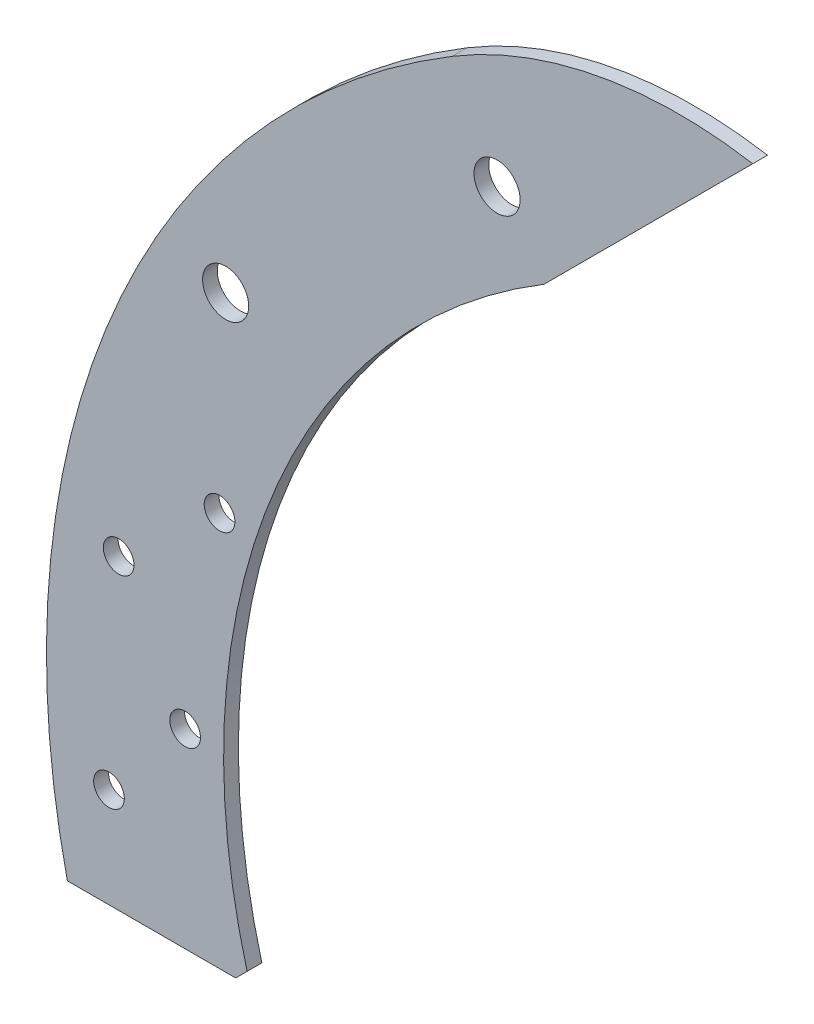
ISO-10303-21;
HEADER;
FILE_DESCRIPTION(('STEP AP214'),'2;1');
FILE_NAME('part.step','',(''),(''),'','','');
FILE_SCHEMA(('AUTOMOTIVE_DESIGN { 1 0 10303 214 1 1 1 1 }'));
ENDSEC;
DATA;
#1=APPLICATION_CONTEXT('core data for automotive mechanical design processes');
#2=APPLICATION_PROTOCOL_DEFINITION('international standard','automotive_design',2000,#1);
#3=PRODUCT_CONTEXT('',#1,'mechanical');
#4=PRODUCT('Part','Part','',(#3));
#5=PRODUCT_RELATED_PRODUCT_CATEGORY('part','',(#4));
#6=PRODUCT_DEFINITION_FORMATION('','',#4);
#7=PRODUCT_DEFINITION_CONTEXT('part definition',#1,'design');
#8=PRODUCT_DEFINITION('design','',#6,#7);
#9=PRODUCT_DEFINITION_SHAPE('','',#8);
#10=(LENGTH_UNIT() NAMED_UNIT(*) SI_UNIT(.MILLI.,.METRE.));
#11=(NAMED_UNIT(*) PLANE_ANGLE_UNIT() SI_UNIT($,.RADIAN.));
#12=(NAMED_UNIT(*) SI_UNIT($,.STERADIAN.) SOLID_ANGLE_UNIT());
#13=UNCERTAINTY_MEASURE_WITH_UNIT(LENGTH_MEASURE(1.E-05),#10,'distance_accuracy_value','');
#14=(GEOMETRIC_REPRESENTATION_CONTEXT(3) GLOBAL_UNCERTAINTY_ASSIGNED_CONTEXT((#13)) GLOBAL_UNIT_ASSIGNED_CONTEXT((#10,
#11,#12)) REPRESENTATION_CONTEXT('',''));
#15=CARTESIAN_POINT('',(0.,0.,0.));
#16=DIRECTION('',(0.,0.,1.));
#17=DIRECTION('',(1.,0.,0.));
#18=AXIS2_PLACEMENT_3D('',#15,#16,#17);
#19=CARTESIAN_POINT('',(-136.505752304852,-34.0622261500945,3.175));
#20=DIRECTION('',(-0.707106781186507,0.707106781186587,0.));
#21=DIRECTION('',(-0.707106781186588,-0.707106781186507,0.));
#22=AXIS2_PLACEMENT_3D('',#19,#20,#21);
#23=PLANE('',#22);
#24=DIRECTION('',(0.707106781186588,0.707106781186507,0.));
#25=VECTOR('',#24,1.);
#26=CARTESIAN_POINT('',(-136.505752304852,-34.0622261500945,0.));
#27=LINE('',#26,#25);
#28=CARTESIAN_POINT('',(-138.956026154758,-36.5125,0.));
#29=VERTEX_POINT('',#28);
#30=CARTESIAN_POINT('',(-136.505752304852,-34.0622261500946,0.));
#31=VERTEX_POINT('',#30);
#32=EDGE_CURVE('E119',#29,#31,#27,.T.);
#33=ORIENTED_EDGE('',*,*,#32,.T.);
#34=DIRECTION('',(0.,0.,-1.));
#35=VECTOR('',#34,1.);
#36=CARTESIAN_POINT('',(-136.505752304852,-34.0622261500946,3.175));
#37=LINE('',#36,#35);
#38=CARTESIAN_POINT('',(-136.505752304852,-34.0622261500946,3.175));
#39=VERTEX_POINT('',#38);
#40=EDGE_CURVE('E11',#39,#31,#37,.T.);
#41=ORIENTED_EDGE('',*,*,#40,.F.);
#42=DIRECTION('',(0.707106781186588,0.707106781186507,0.));
#43=VECTOR('',#42,1.);
#44=CARTESIAN_POINT('',(-136.505752304852,-34.0622261500945,3.175));
#45=LINE('',#44,#43);
#46=CARTESIAN_POINT('',(-138.956026154758,-36.5125,3.175));
#47=VERTEX_POINT('',#46);
#48=EDGE_CURVE('E130',#47,#39,#45,.T.);
#49=ORIENTED_EDGE('',*,*,#48,.F.);
#50=DIRECTION('',(0.,0.,-1.));
#51=VECTOR('',#50,1.);
#52=CARTESIAN_POINT('',(-138.956026154758,-36.5125,3.175));
#53=LINE('',#52,#51);
#54=EDGE_CURVE('E115',#47,#29,#53,.T.);
#55=ORIENTED_EDGE('',*,*,#54,.T.);
#56=EDGE_LOOP('',(#33,#41,#49,#55));
#57=FACE_BOUND('',#56,.T.);
#58=ADVANCED_FACE('F35',(#57),#23,.F.);
#59=CARTESIAN_POINT('',(1.357884,3.589528,3.175));
#60=DIRECTION('',(0.,0.,-1.));
#61=DIRECTION('',(-1.,0.,0.));
#62=AXIS2_PLACEMENT_3D('',#59,#60,#61);
#63=CYLINDRICAL_SURFACE('',#62,142.912689449803);
#64=CARTESIAN_POINT('',(1.357884,3.589528,0.));
#65=DIRECTION('',(0.,0.,-1.));
#66=DIRECTION('',(-1.,0.,0.));
#67=AXIS2_PLACEMENT_3D('',#64,#65,#66);
#68=CIRCLE('',#67,142.912689449803);
#69=CARTESIAN_POINT('',(-72.6557224668079,125.843455804191,0.));
#70=VERTEX_POINT('',#69);
#71=EDGE_CURVE('E122',#31,#70,#68,.T.);
#72=ORIENTED_EDGE('',*,*,#71,.T.);
#73=DIRECTION('',(0.,0.,-1.));
#74=VECTOR('',#73,1.);
#75=CARTESIAN_POINT('',(-72.6557224668079,125.843455804191,3.175));
#76=LINE('',#75,#74);
#77=CARTESIAN_POINT('',(-72.6557224668079,125.843455804191,3.175));
#78=VERTEX_POINT('',#77);
#79=EDGE_CURVE('E43',#78,#70,#76,.T.);
#80=ORIENTED_EDGE('',*,*,#79,.F.);
#81=CARTESIAN_POINT('',(1.357884,3.589528,3.175));
#82=DIRECTION('',(0.,0.,-1.));
#83=DIRECTION('',(-1.,0.,0.));
#84=AXIS2_PLACEMENT_3D('',#81,#82,#83);
#85=CIRCLE('',#84,142.912689449803);
#86=EDGE_CURVE('E88',#39,#78,#85,.T.);
#87=ORIENTED_EDGE('',*,*,#86,.F.);
#88=ORIENTED_EDGE('',*,*,#40,.T.);
#89=EDGE_LOOP('',(#72,#80,#87,#88));
#90=FACE_BOUND('',#89,.T.);
#91=ADVANCED_FACE('F156',(#90),#63,.F.);
#92=CARTESIAN_POINT('',(-72.6557224668079,125.843455804191,3.175));
#93=DIRECTION('',(-0.707106781186549,0.707106781186546,0.));
#94=DIRECTION('',(-0.707106781186546,-0.707106781186549,0.));
#95=AXIS2_PLACEMENT_3D('',#92,#93,#94);
#96=PLANE('',#95);
#97=DIRECTION('',(0.707106781186546,0.707106781186549,0.));
#98=VECTOR('',#97,1.);
#99=CARTESIAN_POINT('',(-72.6557224668079,125.843455804191,0.));
#100=LINE('',#99,#98);
#101=CARTESIAN_POINT('',(-27.7544418614623,170.744736409537,0.));
#102=VERTEX_POINT('',#101);
#103=EDGE_CURVE('E125',#70,#102,#100,.T.);
#104=ORIENTED_EDGE('',*,*,#103,.T.);
#105=DIRECTION('',(0.,0.,-1.));
#106=VECTOR('',#105,1.);
#107=CARTESIAN_POINT('',(-27.7544418614623,170.744736409537,3.175));
#108=LINE('',#107,#106);
#109=CARTESIAN_POINT('',(-27.7544418614623,170.744736409537,3.175));
#110=VERTEX_POINT('',#109);
#111=EDGE_CURVE('E110',#110,#102,#108,.T.);
#112=ORIENTED_EDGE('',*,*,#111,.F.);
#113=DIRECTION('',(0.707106781186546,0.707106781186549,0.));
#114=VECTOR('',#113,1.);
#115=CARTESIAN_POINT('',(-72.6557224668079,125.843455804191,3.175));
#116=LINE('',#115,#114);
#117=EDGE_CURVE('E101',#78,#110,#116,.T.);
#118=ORIENTED_EDGE('',*,*,#117,.F.);
#119=ORIENTED_EDGE('',*,*,#79,.T.);
#120=EDGE_LOOP('',(#104,#112,#118,#119));
#121=FACE_BOUND('',#120,.T.);
#122=ADVANCED_FACE('F136',(#121),#96,.F.);
#123=CARTESIAN_POINT('',(-43.529912777874,77.7341309796209,3.175));
#124=DIRECTION('',(0.,0.,-1.));
#125=DIRECTION('',(-1.,0.,0.));
#126=AXIS2_PLACEMENT_3D('',#123,#124,#125);
#127=CYLINDRICAL_SURFACE('',#126,94.338953805276);
#128=CARTESIAN_POINT('',(-43.529912777874,77.7341309796209,0.));
#129=DIRECTION('',(0.,0.,1.));
#130=DIRECTION('',(-1.,0.,0.));
#131=AXIS2_PLACEMENT_3D('',#128,#129,#130);
#132=CIRCLE('',#131,94.338953805276);
#133=CARTESIAN_POINT('',(-92.3874790885732,158.435905552858,0.));
#134=VERTEX_POINT('',#133);
#135=EDGE_CURVE('E109',#102,#134,#132,.T.);
#136=ORIENTED_EDGE('',*,*,#135,.T.);
#137=DIRECTION('',(0.,0.,-1.));
#138=VECTOR('',#137,1.);
#139=CARTESIAN_POINT('',(-92.3874790885732,158.435905552858,3.175));
#140=LINE('',#139,#138);
#141=CARTESIAN_POINT('',(-92.3874790885732,158.435905552858,3.175));
#142=VERTEX_POINT('',#141);
#143=EDGE_CURVE('E106',#142,#134,#140,.T.);
#144=ORIENTED_EDGE('',*,*,#143,.F.);
#145=CARTESIAN_POINT('',(-43.529912777874,77.7341309796209,3.175));
#146=DIRECTION('',(0.,0.,1.));
#147=DIRECTION('',(-1.,0.,0.));
#148=AXIS2_PLACEMENT_3D('',#145,#146,#147);
#149=CIRCLE('',#148,94.338953805276);
#150=EDGE_CURVE('E95',#110,#142,#149,.T.);
#151=ORIENTED_EDGE('',*,*,#150,.F.);
#152=ORIENTED_EDGE('',*,*,#111,.T.);
#153=EDGE_LOOP('',(#136,#144,#151,#152));
#154=FACE_BOUND('',#153,.T.);
#155=ADVANCED_FACE('F107',(#154),#127,.T.);
#156=CARTESIAN_POINT('',(1.357884,3.589528,3.175));
#157=DIRECTION('',(0.,0.,-1.));
#158=DIRECTION('',(-1.,0.,0.));
#159=AXIS2_PLACEMENT_3D('',#156,#157,#158);
#160=CYLINDRICAL_SURFACE('',#159,181.012689449803);
#161=CARTESIAN_POINT('',(1.357884,3.589528,0.));
#162=DIRECTION('',(0.,0.,1.));
#163=DIRECTION('',(-1.,0.,0.));
#164=AXIS2_PLACEMENT_3D('',#161,#162,#163);
#165=CIRCLE('',#164,181.012689449803);
#166=CARTESIAN_POINT('',(-175.156764378365,-36.5125,0.));
#167=VERTEX_POINT('',#166);
#168=EDGE_CURVE('E74',#134,#167,#165,.T.);
#169=ORIENTED_EDGE('',*,*,#168,.T.);
#170=DIRECTION('',(0.,0.,-1.));
#171=VECTOR('',#170,1.);
#172=CARTESIAN_POINT('',(-175.156764378365,-36.5125,3.175));
#173=LINE('',#172,#171);
#174=CARTESIAN_POINT('',(-175.156764378365,-36.5125,3.175));
#175=VERTEX_POINT('',#174);
#176=EDGE_CURVE('E111',#175,#167,#173,.T.);
#177=ORIENTED_EDGE('',*,*,#176,.F.);
#178=CARTESIAN_POINT('',(1.357884,3.589528,3.175));
#179=DIRECTION('',(0.,0.,1.));
#180=DIRECTION('',(-1.,0.,0.));
#181=AXIS2_PLACEMENT_3D('',#178,#179,#180);
#182=CIRCLE('',#181,181.012689449803);
#183=EDGE_CURVE('E99',#142,#175,#182,.T.);
#184=ORIENTED_EDGE('',*,*,#183,.F.);
#185=ORIENTED_EDGE('',*,*,#143,.T.);
#186=EDGE_LOOP('',(#169,#177,#184,#185));
#187=FACE_BOUND('',#186,.T.);
#188=ADVANCED_FACE('F113',(#187),#160,.T.);
#189=CARTESIAN_POINT('',(-138.956026154758,-36.5125,3.175));
#190=DIRECTION('',(0.,1.,0.));
#191=DIRECTION('',(0.,0.,1.));
#192=AXIS2_PLACEMENT_3D('',#189,#190,#191);
#193=PLANE('',#192);
#194=DIRECTION('',(1.,0.,0.));
#195=VECTOR('',#194,1.);
#196=CARTESIAN_POINT('',(-138.956026154758,-36.5125,0.));
#197=LINE('',#196,#195);
#198=EDGE_CURVE('E80',#167,#29,#197,.T.);
#199=ORIENTED_EDGE('',*,*,#198,.T.);
#200=ORIENTED_EDGE('',*,*,#54,.F.);
#201=DIRECTION('',(1.,0.,0.));
#202=VECTOR('',#201,1.);
#203=CARTESIAN_POINT('',(-138.956026154758,-36.5125,3.175));
#204=LINE('',#203,#202);
#205=EDGE_CURVE('E51',#175,#47,#204,.T.);
#206=ORIENTED_EDGE('',*,*,#205,.F.);
#207=ORIENTED_EDGE('',*,*,#176,.T.);
#208=EDGE_LOOP('',(#199,#200,#206,#207));
#209=FACE_BOUND('',#208,.T.);
#210=ADVANCED_FACE('F143',(#209),#193,.F.);
#211=CARTESIAN_POINT('',(1.357884,3.589528,3.175));
#212=DIRECTION('',(0.,0.,-1.));
#213=DIRECTION('',(-1.,0.,0.));
#214=AXIS2_PLACEMENT_3D('',#211,#212,#213);
#215=PLANE('',#214);
#216=CARTESIAN_POINT('',(-82.7470550017742,138.994736409537,3.175));
#217=DIRECTION('',(0.,0.,1.));
#218=DIRECTION('',(1.,0.,0.));
#219=AXIS2_PLACEMENT_3D('',#216,#217,#218);
#220=CIRCLE('',#219,4.96100099999999);
#221=CARTESIAN_POINT('',(-77.7860540017742,138.994736409537,3.175));
#222=VERTEX_POINT('',#221);
#223=EDGE_CURVE('E257',#222,#222,#220,.T.);
#224=ORIENTED_EDGE('',*,*,#223,.F.);
#225=EDGE_LOOP('',(#224));
#226=FACE_BOUND('',#225,.T.);
#227=CARTESIAN_POINT('',(-141.11964156744,90.0143205514218,3.175));
#228=DIRECTION('',(0.,0.,1.));
#229=DIRECTION('',(1.,0.,0.));
#230=AXIS2_PLACEMENT_3D('',#227,#228,#229);
#231=CIRCLE('',#230,4.96100099999999);
#232=CARTESIAN_POINT('',(-136.15864056744,90.0143205514218,3.175));
#233=VERTEX_POINT('',#232);
#234=EDGE_CURVE('E259',#233,#233,#231,.T.);
#235=ORIENTED_EDGE('',*,*,#234,.F.);
#236=EDGE_LOOP('',(#235));
#237=FACE_BOUND('',#236,.T.);
#238=CARTESIAN_POINT('',(-166.205357893552,-15.0736471775281,3.175));
#239=DIRECTION('',(0.,0.,1.));
#240=DIRECTION('',(1.,0.,0.));
#241=AXIS2_PLACEMENT_3D('',#238,#239,#240);
#242=CIRCLE('',#241,3.30200000000001);
#243=CARTESIAN_POINT('',(-162.903357893552,-15.0736471775281,3.175));
#244=VERTEX_POINT('',#243);
#245=EDGE_CURVE('E267',#244,#244,#242,.T.);
#246=ORIENTED_EDGE('',*,*,#245,.F.);
#247=EDGE_LOOP('',(#246));
#248=FACE_BOUND('',#247,.T.);
#249=CARTESIAN_POINT('',(-164.125827505257,29.4335038147387,3.175));
#250=DIRECTION('',(0.,0.,1.));
#251=DIRECTION('',(1.,0.,0.));
#252=AXIS2_PLACEMENT_3D('',#249,#250,#251);
#253=CIRCLE('',#252,3.30200000000001);
#254=CARTESIAN_POINT('',(-160.823827505257,29.4335038147387,3.175));
#255=VERTEX_POINT('',#254);
#256=EDGE_CURVE('E273',#255,#255,#253,.T.);
#257=ORIENTED_EDGE('',*,*,#256,.F.);
#258=EDGE_LOOP('',(#257));
#259=FACE_BOUND('',#258,.T.);
#260=CARTESIAN_POINT('',(-149.837364130512,4.445,3.175));
#261=DIRECTION('',(0.,0.,1.));
#262=DIRECTION('',(1.,0.,0.));
#263=AXIS2_PLACEMENT_3D('',#260,#261,#262);
#264=CIRCLE('',#263,3.30200000000001);
#265=CARTESIAN_POINT('',(-146.535364130512,4.445,3.175));
#266=VERTEX_POINT('',#265);
#267=EDGE_CURVE('E279',#266,#266,#264,.T.);
#268=ORIENTED_EDGE('',*,*,#267,.F.);
#269=EDGE_LOOP('',(#268));
#270=FACE_BOUND('',#269,.T.);
#271=CARTESIAN_POINT('',(-142.42715530255,48.3478669589237,3.175));
#272=DIRECTION('',(0.,0.,1.));
#273=DIRECTION('',(1.,0.,0.));
#274=AXIS2_PLACEMENT_3D('',#271,#272,#273);
#275=CIRCLE('',#274,3.30200000000001);
#276=CARTESIAN_POINT('',(-139.12515530255,48.3478669589237,3.175));
#277=VERTEX_POINT('',#276);
#278=EDGE_CURVE('E285',#277,#277,#275,.T.);
#279=ORIENTED_EDGE('',*,*,#278,.F.);
#280=EDGE_LOOP('',(#279));
#281=FACE_BOUND('',#280,.T.);
#282=ORIENTED_EDGE('',*,*,#48,.T.);
#283=ORIENTED_EDGE('',*,*,#86,.T.);
#284=ORIENTED_EDGE('',*,*,#117,.T.);
#285=ORIENTED_EDGE('',*,*,#150,.T.);
#286=ORIENTED_EDGE('',*,*,#183,.T.);
#287=ORIENTED_EDGE('',*,*,#205,.T.);
#288=EDGE_LOOP('',(#282,#283,#284,#285,#286,#287));
#289=FACE_BOUND('',#288,.T.);
#290=ADVANCED_FACE('F97',(#226,#237,#248,#259,#270,#281,#289),#215,.F.);
#291=CARTESIAN_POINT('',(1.357884,3.589528,0.));
#292=DIRECTION('',(0.,0.,-1.));
#293=DIRECTION('',(-1.,0.,0.));
#294=AXIS2_PLACEMENT_3D('',#291,#292,#293);
#295=PLANE('',#294);
#296=CARTESIAN_POINT('',(-82.7470550017742,138.994736409537,0.));
#297=DIRECTION('',(0.,0.,1.));
#298=DIRECTION('',(1.,0.,0.));
#299=AXIS2_PLACEMENT_3D('',#296,#297,#298);
#300=CIRCLE('',#299,4.96100100000001);
#301=CARTESIAN_POINT('',(-77.7860540017742,138.994736409537,0.));
#302=VERTEX_POINT('',#301);
#303=EDGE_CURVE('E254',#302,#302,#300,.T.);
#304=ORIENTED_EDGE('',*,*,#303,.T.);
#305=EDGE_LOOP('',(#304));
#306=FACE_BOUND('',#305,.T.);
#307=CARTESIAN_POINT('',(-141.11964156744,90.0143205514218,0.));
#308=DIRECTION('',(0.,0.,1.));
#309=DIRECTION('',(1.,0.,0.));
#310=AXIS2_PLACEMENT_3D('',#307,#308,#309);
#311=CIRCLE('',#310,4.96100099999999);
#312=CARTESIAN_POINT('',(-136.15864056744,90.0143205514218,0.));
#313=VERTEX_POINT('',#312);
#314=EDGE_CURVE('E264',#313,#313,#311,.T.);
#315=ORIENTED_EDGE('',*,*,#314,.T.);
#316=EDGE_LOOP('',(#315));
#317=FACE_BOUND('',#316,.T.);
#318=CARTESIAN_POINT('',(-166.205357893552,-15.0736471775281,0.));
#319=DIRECTION('',(0.,0.,-1.));
#320=DIRECTION('',(-1.,0.,0.));
#321=AXIS2_PLACEMENT_3D('',#318,#319,#320);
#322=CIRCLE('',#321,3.30200000000001);
#323=CARTESIAN_POINT('',(-169.507357893552,-15.0736471775281,0.));
#324=VERTEX_POINT('',#323);
#325=EDGE_CURVE('E270',#324,#324,#322,.F.);
#326=ORIENTED_EDGE('',*,*,#325,.T.);
#327=EDGE_LOOP('',(#326));
#328=FACE_BOUND('',#327,.T.);
#329=CARTESIAN_POINT('',(-164.125827505257,29.4335038147387,0.));
#330=DIRECTION('',(0.,0.,-1.));
#331=DIRECTION('',(-1.,0.,0.));
#332=AXIS2_PLACEMENT_3D('',#329,#330,#331);
#333=CIRCLE('',#332,3.30200000000001);
#334=CARTESIAN_POINT('',(-167.427827505257,29.4335038147387,0.));
#335=VERTEX_POINT('',#334);
#336=EDGE_CURVE('E276',#335,#335,#333,.F.);
#337=ORIENTED_EDGE('',*,*,#336,.T.);
#338=EDGE_LOOP('',(#337));
#339=FACE_BOUND('',#338,.T.);
#340=CARTESIAN_POINT('',(-149.837364130512,4.445,0.));
#341=DIRECTION('',(0.,0.,-1.));
#342=DIRECTION('',(-1.,0.,0.));
#343=AXIS2_PLACEMENT_3D('',#340,#341,#342);
#344=CIRCLE('',#343,3.30200000000001);
#345=CARTESIAN_POINT('',(-153.139364130512,4.445,0.));
#346=VERTEX_POINT('',#345);
#347=EDGE_CURVE('E282',#346,#346,#344,.F.);
#348=ORIENTED_EDGE('',*,*,#347,.T.);
#349=EDGE_LOOP('',(#348));
#350=FACE_BOUND('',#349,.T.);
#351=CARTESIAN_POINT('',(-142.42715530255,48.3478669589237,0.));
#352=DIRECTION('',(0.,0.,-1.));
#353=DIRECTION('',(-1.,0.,0.));
#354=AXIS2_PLACEMENT_3D('',#351,#352,#353);
#355=CIRCLE('',#354,3.30200000000001);
#356=CARTESIAN_POINT('',(-145.72915530255,48.3478669589237,0.));
#357=VERTEX_POINT('',#356);
#358=EDGE_CURVE('E123',#357,#357,#355,.F.);
#359=ORIENTED_EDGE('',*,*,#358,.T.);
#360=EDGE_LOOP('',(#359));
#361=FACE_BOUND('',#360,.T.);
#362=ORIENTED_EDGE('',*,*,#32,.F.);
#363=ORIENTED_EDGE('',*,*,#198,.F.);
#364=ORIENTED_EDGE('',*,*,#168,.F.);
#365=ORIENTED_EDGE('',*,*,#135,.F.);
#366=ORIENTED_EDGE('',*,*,#103,.F.);
#367=ORIENTED_EDGE('',*,*,#71,.F.);
#368=EDGE_LOOP('',(#362,#363,#364,#365,#366,#367));
#369=FACE_BOUND('',#368,.T.);
#370=ADVANCED_FACE('F139',(#306,#317,#328,#339,#350,#361,#369),#295,.T.);
#371=CARTESIAN_POINT('',(-142.42715530255,48.3478669589237,-9.33946636591194));
#372=DIRECTION('',(0.,0.,1.));
#373=DIRECTION('',(1.,0.,0.));
#374=AXIS2_PLACEMENT_3D('',#371,#372,#373);
#375=CYLINDRICAL_SURFACE('',#374,3.30200000000001);
#376=ORIENTED_EDGE('',*,*,#278,.T.);
#377=EDGE_LOOP('',(#376));
#378=FACE_BOUND('',#377,.T.);
#379=ORIENTED_EDGE('',*,*,#358,.F.);
#380=EDGE_LOOP('',(#379));
#381=FACE_BOUND('',#380,.T.);
#382=ADVANCED_FACE('F184',(#378,#381),#375,.F.);
#383=CARTESIAN_POINT('',(-149.837364130512,4.445,-9.33946636591194));
#384=DIRECTION('',(0.,0.,1.));
#385=DIRECTION('',(1.,0.,0.));
#386=AXIS2_PLACEMENT_3D('',#383,#384,#385);
#387=CYLINDRICAL_SURFACE('',#386,3.30200000000001);
#388=ORIENTED_EDGE('',*,*,#267,.T.);
#389=EDGE_LOOP('',(#388));
#390=FACE_BOUND('',#389,.T.);
#391=ORIENTED_EDGE('',*,*,#347,.F.);
#392=EDGE_LOOP('',(#391));
#393=FACE_BOUND('',#392,.T.);
#394=ADVANCED_FACE('F189',(#390,#393),#387,.F.);
#395=CARTESIAN_POINT('',(-164.125827505257,29.4335038147387,-9.33946636591194));
#396=DIRECTION('',(0.,0.,1.));
#397=DIRECTION('',(1.,0.,0.));
#398=AXIS2_PLACEMENT_3D('',#395,#396,#397);
#399=CYLINDRICAL_SURFACE('',#398,3.30200000000001);
#400=ORIENTED_EDGE('',*,*,#256,.T.);
#401=EDGE_LOOP('',(#400));
#402=FACE_BOUND('',#401,.T.);
#403=ORIENTED_EDGE('',*,*,#336,.F.);
#404=EDGE_LOOP('',(#403));
#405=FACE_BOUND('',#404,.T.);
#406=ADVANCED_FACE('F201',(#402,#405),#399,.F.);
#407=CARTESIAN_POINT('',(-166.205357893552,-15.0736471775281,-9.33946636591194));
#408=DIRECTION('',(0.,0.,1.));
#409=DIRECTION('',(1.,0.,0.));
#410=AXIS2_PLACEMENT_3D('',#407,#408,#409);
#411=CYLINDRICAL_SURFACE('',#410,3.30200000000001);
#412=ORIENTED_EDGE('',*,*,#245,.T.);
#413=EDGE_LOOP('',(#412));
#414=FACE_BOUND('',#413,.T.);
#415=ORIENTED_EDGE('',*,*,#325,.F.);
#416=EDGE_LOOP('',(#415));
#417=FACE_BOUND('',#416,.T.);
#418=ADVANCED_FACE('F211',(#414,#417),#411,.F.);
#419=CARTESIAN_POINT('',(-141.11964156744,90.0143205514218,3.175));
#420=DIRECTION('',(0.,0.,1.));
#421=DIRECTION('',(1.,0.,0.));
#422=AXIS2_PLACEMENT_3D('',#419,#420,#421);
#423=CYLINDRICAL_SURFACE('',#422,4.96100099999999);
#424=ORIENTED_EDGE('',*,*,#314,.F.);
#425=EDGE_LOOP('',(#424));
#426=FACE_BOUND('',#425,.T.);
#427=ORIENTED_EDGE('',*,*,#234,.T.);
#428=EDGE_LOOP('',(#427));
#429=FACE_BOUND('',#428,.T.);
#430=ADVANCED_FACE('F220',(#426,#429),#423,.F.);
#431=CARTESIAN_POINT('',(-82.7470550017742,138.994736409537,3.175));
#432=DIRECTION('',(0.,0.,1.));
#433=DIRECTION('',(1.,0.,0.));
#434=AXIS2_PLACEMENT_3D('',#431,#432,#433);
#435=CYLINDRICAL_SURFACE('',#434,4.961001);
#436=ORIENTED_EDGE('',*,*,#303,.F.);
#437=EDGE_LOOP('',(#436));
#438=FACE_BOUND('',#437,.T.);
#439=ORIENTED_EDGE('',*,*,#223,.T.);
#440=EDGE_LOOP('',(#439));
#441=FACE_BOUND('',#440,.T.);
#442=ADVANCED_FACE('F237',(#438,#441),#435,.F.);
#443=CLOSED_SHELL('',(#58,#91,#122,#155,#188,#210,#290,#370,#382,#394,#406,#418,#430,#442));
#444=MANIFOLD_SOLID_BREP('B2',#443);
#445=ADVANCED_BREP_SHAPE_REPRESENTATION('',(#18,#444),#14);
#446=SHAPE_DEFINITION_REPRESENTATION(#9,#445);
ENDSEC;
END-ISO-10303-21;
